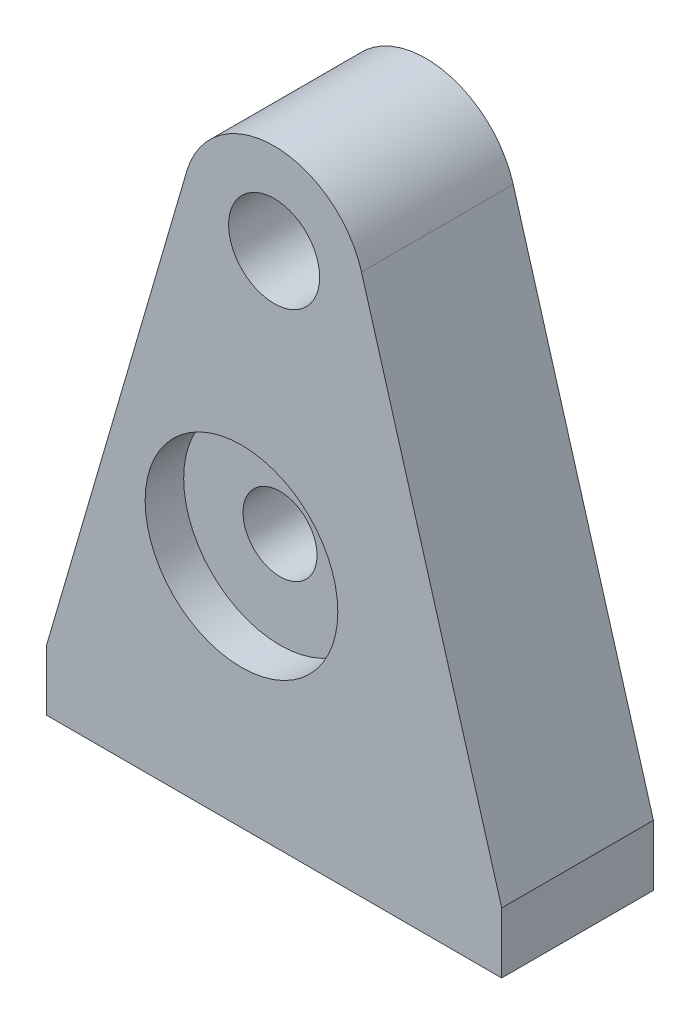
ISO-10303-21;
HEADER;
FILE_DESCRIPTION(('STEP AP214'),'2;1');
FILE_NAME('part.step','',(''),(''),'','','');
FILE_SCHEMA(('AUTOMOTIVE_DESIGN { 1 0 10303 214 1 1 1 1 }'));
ENDSEC;
DATA;
#1=APPLICATION_CONTEXT('core data for automotive mechanical design processes');
#2=APPLICATION_PROTOCOL_DEFINITION('international standard','automotive_design',2000,#1);
#3=PRODUCT_CONTEXT('',#1,'mechanical');
#4=PRODUCT('Part','Part','',(#3));
#5=PRODUCT_RELATED_PRODUCT_CATEGORY('part','',(#4));
#6=PRODUCT_DEFINITION_FORMATION('','',#4);
#7=PRODUCT_DEFINITION_CONTEXT('part definition',#1,'design');
#8=PRODUCT_DEFINITION('design','',#6,#7);
#9=PRODUCT_DEFINITION_SHAPE('','',#8);
#10=(LENGTH_UNIT() NAMED_UNIT(*) SI_UNIT(.MILLI.,.METRE.));
#11=(NAMED_UNIT(*) PLANE_ANGLE_UNIT() SI_UNIT($,.RADIAN.));
#12=(NAMED_UNIT(*) SI_UNIT($,.STERADIAN.) SOLID_ANGLE_UNIT());
#13=UNCERTAINTY_MEASURE_WITH_UNIT(LENGTH_MEASURE(1.E-05),#10,'distance_accuracy_value','');
#14=(GEOMETRIC_REPRESENTATION_CONTEXT(3) GLOBAL_UNCERTAINTY_ASSIGNED_CONTEXT((#13)) GLOBAL_UNIT_ASSIGNED_CONTEXT((#10,
#11,#12)) REPRESENTATION_CONTEXT('',''));
#15=CARTESIAN_POINT('',(0.,0.,0.));
#16=DIRECTION('',(0.,0.,1.));
#17=DIRECTION('',(1.,0.,0.));
#18=AXIS2_PLACEMENT_3D('',#15,#16,#17);
#19=CARTESIAN_POINT('',(7.5,15.,5.));
#20=DIRECTION('',(0.,0.,1.));
#21=DIRECTION('',(1.,0.,0.));
#22=AXIS2_PLACEMENT_3D('',#19,#20,#21);
#23=PLANE('',#22);
#24=CARTESIAN_POINT('',(6.42340323711557,5.75018881602358,5.));
#25=DIRECTION('',(0.,0.,1.));
#26=DIRECTION('',(1.,0.,0.));
#27=AXIS2_PLACEMENT_3D('',#24,#25,#26);
#28=CIRCLE('',#27,3.175);
#29=CARTESIAN_POINT('',(9.59840323711557,5.75018881602358,5.));
#30=VERTEX_POINT('',#29);
#31=EDGE_CURVE('E193',#30,#30,#28,.T.);
#32=ORIENTED_EDGE('',*,*,#31,.F.);
#33=EDGE_LOOP('',(#32));
#34=FACE_BOUND('',#33,.T.);
#35=DIRECTION('',(0.,-1.,0.));
#36=VECTOR('',#35,1.);
#37=CARTESIAN_POINT('',(0.,0.,5.));
#38=LINE('',#37,#36);
#39=CARTESIAN_POINT('',(0.,0.,5.));
#40=VERTEX_POINT('',#39);
#41=CARTESIAN_POINT('',(0.,-2.,5.));
#42=VERTEX_POINT('',#41);
#43=EDGE_CURVE('E141',#40,#42,#38,.T.);
#44=ORIENTED_EDGE('',*,*,#43,.T.);
#45=DIRECTION('',(1.,0.,0.));
#46=VECTOR('',#45,1.);
#47=CARTESIAN_POINT('',(0.,-2.,5.));
#48=LINE('',#47,#46);
#49=CARTESIAN_POINT('',(15.,-2.,5.));
#50=VERTEX_POINT('',#49);
#51=EDGE_CURVE('E99',#42,#50,#48,.T.);
#52=ORIENTED_EDGE('',*,*,#51,.T.);
#53=DIRECTION('',(0.,1.,0.));
#54=VECTOR('',#53,1.);
#55=CARTESIAN_POINT('',(15.,0.,5.));
#56=LINE('',#55,#54);
#57=CARTESIAN_POINT('',(15.,0.,5.));
#58=VERTEX_POINT('',#57);
#59=EDGE_CURVE('E112',#50,#58,#56,.T.);
#60=ORIENTED_EDGE('',*,*,#59,.T.);
#61=DIRECTION('',(-0.28,0.96,0.));
#62=VECTOR('',#61,1.);
#63=CARTESIAN_POINT('',(15.,0.,5.));
#64=LINE('',#63,#62);
#65=CARTESIAN_POINT('',(10.38,15.84,5.));
#66=VERTEX_POINT('',#65);
#67=EDGE_CURVE('E106',#58,#66,#64,.T.);
#68=ORIENTED_EDGE('',*,*,#67,.T.);
#69=CARTESIAN_POINT('',(7.5,15.,5.));
#70=DIRECTION('',(0.,0.,1.));
#71=DIRECTION('',(1.,0.,0.));
#72=AXIS2_PLACEMENT_3D('',#69,#70,#71);
#73=CIRCLE('',#72,3.);
#74=CARTESIAN_POINT('',(4.62,15.84,5.));
#75=VERTEX_POINT('',#74);
#76=EDGE_CURVE('E110',#66,#75,#73,.T.);
#77=ORIENTED_EDGE('',*,*,#76,.T.);
#78=DIRECTION('',(-0.28,-0.96,0.));
#79=VECTOR('',#78,1.);
#80=CARTESIAN_POINT('',(0.,0.,5.));
#81=LINE('',#80,#79);
#82=EDGE_CURVE('E62',#75,#40,#81,.T.);
#83=ORIENTED_EDGE('',*,*,#82,.T.);
#84=EDGE_LOOP('',(#44,#52,#60,#68,#77,#83));
#85=FACE_BOUND('',#84,.T.);
#86=CARTESIAN_POINT('',(7.5,15.,5.));
#87=DIRECTION('',(0.,0.,1.));
#88=DIRECTION('',(1.,0.,0.));
#89=AXIS2_PLACEMENT_3D('',#86,#87,#88);
#90=CIRCLE('',#89,1.5);
#91=CARTESIAN_POINT('',(9.,15.,5.));
#92=VERTEX_POINT('',#91);
#93=EDGE_CURVE('E134',#92,#92,#90,.T.);
#94=ORIENTED_EDGE('',*,*,#93,.F.);
#95=EDGE_LOOP('',(#94));
#96=FACE_BOUND('',#95,.T.);
#97=ADVANCED_FACE('F45',(#34,#85,#96),#23,.T.);
#98=CARTESIAN_POINT('',(7.5,15.,0.));
#99=DIRECTION('',(0.,0.,1.));
#100=DIRECTION('',(1.,0.,0.));
#101=AXIS2_PLACEMENT_3D('',#98,#99,#100);
#102=PLANE('',#101);
#103=CARTESIAN_POINT('',(6.42340323711557,5.75018881602358,0.));
#104=DIRECTION('',(0.,0.,1.));
#105=DIRECTION('',(1.,0.,0.));
#106=AXIS2_PLACEMENT_3D('',#103,#104,#105);
#107=CIRCLE('',#106,1.2192);
#108=CARTESIAN_POINT('',(7.64260323711557,5.75018881602358,0.));
#109=VERTEX_POINT('',#108);
#110=EDGE_CURVE('E200',#109,#109,#107,.T.);
#111=ORIENTED_EDGE('',*,*,#110,.T.);
#112=EDGE_LOOP('',(#111));
#113=FACE_BOUND('',#112,.T.);
#114=DIRECTION('',(0.,-1.,0.));
#115=VECTOR('',#114,1.);
#116=CARTESIAN_POINT('',(0.,0.,0.));
#117=LINE('',#116,#115);
#118=CARTESIAN_POINT('',(0.,0.,0.));
#119=VERTEX_POINT('',#118);
#120=CARTESIAN_POINT('',(0.,-2.,0.));
#121=VERTEX_POINT('',#120);
#122=EDGE_CURVE('E130',#119,#121,#117,.T.);
#123=ORIENTED_EDGE('',*,*,#122,.F.);
#124=DIRECTION('',(-0.28,-0.96,0.));
#125=VECTOR('',#124,1.);
#126=CARTESIAN_POINT('',(0.,0.,0.));
#127=LINE('',#126,#125);
#128=CARTESIAN_POINT('',(4.62,15.84,0.));
#129=VERTEX_POINT('',#128);
#130=EDGE_CURVE('E91',#129,#119,#127,.T.);
#131=ORIENTED_EDGE('',*,*,#130,.F.);
#132=CARTESIAN_POINT('',(7.5,15.,0.));
#133=DIRECTION('',(0.,0.,1.));
#134=DIRECTION('',(1.,0.,0.));
#135=AXIS2_PLACEMENT_3D('',#132,#133,#134);
#136=CIRCLE('',#135,3.);
#137=CARTESIAN_POINT('',(10.38,15.84,0.));
#138=VERTEX_POINT('',#137);
#139=EDGE_CURVE('E85',#138,#129,#136,.T.);
#140=ORIENTED_EDGE('',*,*,#139,.F.);
#141=DIRECTION('',(-0.28,0.96,0.));
#142=VECTOR('',#141,1.);
#143=CARTESIAN_POINT('',(15.,0.,0.));
#144=LINE('',#143,#142);
#145=CARTESIAN_POINT('',(15.,0.,0.));
#146=VERTEX_POINT('',#145);
#147=EDGE_CURVE('E120',#146,#138,#144,.T.);
#148=ORIENTED_EDGE('',*,*,#147,.F.);
#149=DIRECTION('',(0.,1.,0.));
#150=VECTOR('',#149,1.);
#151=CARTESIAN_POINT('',(15.,0.,0.));
#152=LINE('',#151,#150);
#153=CARTESIAN_POINT('',(15.,-2.,0.));
#154=VERTEX_POINT('',#153);
#155=EDGE_CURVE('E136',#154,#146,#152,.T.);
#156=ORIENTED_EDGE('',*,*,#155,.F.);
#157=DIRECTION('',(1.,0.,0.));
#158=VECTOR('',#157,1.);
#159=CARTESIAN_POINT('',(0.,-2.,0.));
#160=LINE('',#159,#158);
#161=EDGE_CURVE('E133',#121,#154,#160,.T.);
#162=ORIENTED_EDGE('',*,*,#161,.F.);
#163=EDGE_LOOP('',(#123,#131,#140,#148,#156,#162));
#164=FACE_BOUND('',#163,.T.);
#165=CARTESIAN_POINT('',(7.5,15.,0.));
#166=DIRECTION('',(0.,0.,1.));
#167=DIRECTION('',(1.,0.,0.));
#168=AXIS2_PLACEMENT_3D('',#165,#166,#167);
#169=CIRCLE('',#168,1.5);
#170=CARTESIAN_POINT('',(9.,15.,0.));
#171=VERTEX_POINT('',#170);
#172=EDGE_CURVE('E203',#171,#171,#169,.T.);
#173=ORIENTED_EDGE('',*,*,#172,.T.);
#174=EDGE_LOOP('',(#173));
#175=FACE_BOUND('',#174,.T.);
#176=ADVANCED_FACE('F150',(#113,#164,#175),#102,.F.);
#177=CARTESIAN_POINT('',(0.,0.,5.));
#178=DIRECTION('',(1.,0.,0.));
#179=DIRECTION('',(0.,1.,0.));
#180=AXIS2_PLACEMENT_3D('',#177,#178,#179);
#181=PLANE('',#180);
#182=ORIENTED_EDGE('',*,*,#122,.T.);
#183=DIRECTION('',(0.,0.,-1.));
#184=VECTOR('',#183,1.);
#185=CARTESIAN_POINT('',(0.,-2.,5.));
#186=LINE('',#185,#184);
#187=EDGE_CURVE('E11',#42,#121,#186,.T.);
#188=ORIENTED_EDGE('',*,*,#187,.F.);
#189=ORIENTED_EDGE('',*,*,#43,.F.);
#190=DIRECTION('',(0.,0.,-1.));
#191=VECTOR('',#190,1.);
#192=CARTESIAN_POINT('',(0.,0.,5.));
#193=LINE('',#192,#191);
#194=EDGE_CURVE('E126',#40,#119,#193,.T.);
#195=ORIENTED_EDGE('',*,*,#194,.T.);
#196=EDGE_LOOP('',(#182,#188,#189,#195));
#197=FACE_BOUND('',#196,.T.);
#198=ADVANCED_FACE('F47',(#197),#181,.F.);
#199=CARTESIAN_POINT('',(0.,-2.,5.));
#200=DIRECTION('',(0.,1.,0.));
#201=DIRECTION('',(0.,0.,1.));
#202=AXIS2_PLACEMENT_3D('',#199,#200,#201);
#203=PLANE('',#202);
#204=ORIENTED_EDGE('',*,*,#161,.T.);
#205=DIRECTION('',(0.,0.,-1.));
#206=VECTOR('',#205,1.);
#207=CARTESIAN_POINT('',(15.,-2.,5.));
#208=LINE('',#207,#206);
#209=EDGE_CURVE('E54',#50,#154,#208,.T.);
#210=ORIENTED_EDGE('',*,*,#209,.F.);
#211=ORIENTED_EDGE('',*,*,#51,.F.);
#212=ORIENTED_EDGE('',*,*,#187,.T.);
#213=EDGE_LOOP('',(#204,#210,#211,#212));
#214=FACE_BOUND('',#213,.T.);
#215=ADVANCED_FACE('F259',(#214),#203,.F.);
#216=CARTESIAN_POINT('',(15.,0.,5.));
#217=DIRECTION('',(-1.,0.,0.));
#218=DIRECTION('',(0.,0.,1.));
#219=AXIS2_PLACEMENT_3D('',#216,#217,#218);
#220=PLANE('',#219);
#221=ORIENTED_EDGE('',*,*,#155,.T.);
#222=DIRECTION('',(0.,0.,-1.));
#223=VECTOR('',#222,1.);
#224=CARTESIAN_POINT('',(15.,0.,5.));
#225=LINE('',#224,#223);
#226=EDGE_CURVE('E121',#58,#146,#225,.T.);
#227=ORIENTED_EDGE('',*,*,#226,.F.);
#228=ORIENTED_EDGE('',*,*,#59,.F.);
#229=ORIENTED_EDGE('',*,*,#209,.T.);
#230=EDGE_LOOP('',(#221,#227,#228,#229));
#231=FACE_BOUND('',#230,.T.);
#232=ADVANCED_FACE('F147',(#231),#220,.F.);
#233=CARTESIAN_POINT('',(15.,0.,5.));
#234=DIRECTION('',(-0.96,-0.28,0.));
#235=DIRECTION('',(0.28,-0.96,0.));
#236=AXIS2_PLACEMENT_3D('',#233,#234,#235);
#237=PLANE('',#236);
#238=ORIENTED_EDGE('',*,*,#147,.T.);
#239=DIRECTION('',(0.,0.,-1.));
#240=VECTOR('',#239,1.);
#241=CARTESIAN_POINT('',(10.38,15.84,5.));
#242=LINE('',#241,#240);
#243=EDGE_CURVE('E117',#66,#138,#242,.T.);
#244=ORIENTED_EDGE('',*,*,#243,.F.);
#245=ORIENTED_EDGE('',*,*,#67,.F.);
#246=ORIENTED_EDGE('',*,*,#226,.T.);
#247=EDGE_LOOP('',(#238,#244,#245,#246));
#248=FACE_BOUND('',#247,.T.);
#249=ADVANCED_FACE('F118',(#248),#237,.F.);
#250=CARTESIAN_POINT('',(7.5,15.,5.));
#251=DIRECTION('',(0.,0.,-1.));
#252=DIRECTION('',(-1.,0.,0.));
#253=AXIS2_PLACEMENT_3D('',#250,#251,#252);
#254=CYLINDRICAL_SURFACE('',#253,3.);
#255=ORIENTED_EDGE('',*,*,#139,.T.);
#256=DIRECTION('',(0.,0.,-1.));
#257=VECTOR('',#256,1.);
#258=CARTESIAN_POINT('',(4.62,15.84,5.));
#259=LINE('',#258,#257);
#260=EDGE_CURVE('E122',#75,#129,#259,.T.);
#261=ORIENTED_EDGE('',*,*,#260,.F.);
#262=ORIENTED_EDGE('',*,*,#76,.F.);
#263=ORIENTED_EDGE('',*,*,#243,.T.);
#264=EDGE_LOOP('',(#255,#261,#262,#263));
#265=FACE_BOUND('',#264,.T.);
#266=ADVANCED_FACE('F124',(#265),#254,.T.);
#267=CARTESIAN_POINT('',(0.,0.,5.));
#268=DIRECTION('',(0.96,-0.28,0.));
#269=DIRECTION('',(0.28,0.96,0.));
#270=AXIS2_PLACEMENT_3D('',#267,#268,#269);
#271=PLANE('',#270);
#272=ORIENTED_EDGE('',*,*,#130,.T.);
#273=ORIENTED_EDGE('',*,*,#194,.F.);
#274=ORIENTED_EDGE('',*,*,#82,.F.);
#275=ORIENTED_EDGE('',*,*,#260,.T.);
#276=EDGE_LOOP('',(#272,#273,#274,#275));
#277=FACE_BOUND('',#276,.T.);
#278=ADVANCED_FACE('F155',(#277),#271,.F.);
#279=CARTESIAN_POINT('',(7.5,15.,5.));
#280=DIRECTION('',(0.,0.,-1.));
#281=DIRECTION('',(-1.,0.,0.));
#282=AXIS2_PLACEMENT_3D('',#279,#280,#281);
#283=CYLINDRICAL_SURFACE('',#282,1.5);
#284=ORIENTED_EDGE('',*,*,#93,.T.);
#285=EDGE_LOOP('',(#284));
#286=FACE_BOUND('',#285,.T.);
#287=ORIENTED_EDGE('',*,*,#172,.F.);
#288=EDGE_LOOP('',(#287));
#289=FACE_BOUND('',#288,.T.);
#290=ADVANCED_FACE('F157',(#286,#289),#283,.F.);
#291=CARTESIAN_POINT('',(6.42340323711557,5.75018881602358,5.));
#292=DIRECTION('',(0.,0.,1.));
#293=DIRECTION('',(1.,0.,0.));
#294=AXIS2_PLACEMENT_3D('',#291,#292,#293);
#295=CYLINDRICAL_SURFACE('',#294,1.2192);
#296=ORIENTED_EDGE('',*,*,#110,.F.);
#297=EDGE_LOOP('',(#296));
#298=FACE_BOUND('',#297,.T.);
#299=CARTESIAN_POINT('',(6.42340323711557,5.75018881602358,3.73));
#300=DIRECTION('',(0.,0.,1.));
#301=DIRECTION('',(1.,0.,0.));
#302=AXIS2_PLACEMENT_3D('',#299,#300,#301);
#303=CIRCLE('',#302,1.2192);
#304=CARTESIAN_POINT('',(7.64260323711557,5.75018881602358,3.73));
#305=VERTEX_POINT('',#304);
#306=EDGE_CURVE('E195',#305,#305,#303,.T.);
#307=ORIENTED_EDGE('',*,*,#306,.T.);
#308=EDGE_LOOP('',(#307));
#309=FACE_BOUND('',#308,.T.);
#310=ADVANCED_FACE('F164',(#298,#309),#295,.F.);
#311=CARTESIAN_POINT('',(7.64260323711557,5.75018881602358,3.73));
#312=DIRECTION('',(0.,0.,-1.));
#313=DIRECTION('',(-1.,0.,0.));
#314=AXIS2_PLACEMENT_3D('',#311,#312,#313);
#315=PLANE('',#314);
#316=ORIENTED_EDGE('',*,*,#306,.F.);
#317=EDGE_LOOP('',(#316));
#318=FACE_BOUND('',#317,.T.);
#319=CARTESIAN_POINT('',(6.42340323711557,5.75018881602358,3.73));
#320=DIRECTION('',(0.,0.,1.));
#321=DIRECTION('',(1.,0.,0.));
#322=AXIS2_PLACEMENT_3D('',#319,#320,#321);
#323=CIRCLE('',#322,3.175);
#324=CARTESIAN_POINT('',(9.59840323711557,5.75018881602358,3.73));
#325=VERTEX_POINT('',#324);
#326=EDGE_CURVE('E191',#325,#325,#323,.T.);
#327=ORIENTED_EDGE('',*,*,#326,.T.);
#328=EDGE_LOOP('',(#327));
#329=FACE_BOUND('',#328,.T.);
#330=ADVANCED_FACE('F179',(#318,#329),#315,.F.);
#331=CARTESIAN_POINT('',(6.42340323711557,5.75018881602358,5.));
#332=DIRECTION('',(0.,0.,1.));
#333=DIRECTION('',(1.,0.,0.));
#334=AXIS2_PLACEMENT_3D('',#331,#332,#333);
#335=CYLINDRICAL_SURFACE('',#334,3.175);
#336=ORIENTED_EDGE('',*,*,#326,.F.);
#337=EDGE_LOOP('',(#336));
#338=FACE_BOUND('',#337,.T.);
#339=ORIENTED_EDGE('',*,*,#31,.T.);
#340=EDGE_LOOP('',(#339));
#341=FACE_BOUND('',#340,.T.);
#342=ADVANCED_FACE('F183',(#338,#341),#335,.F.);
#343=CLOSED_SHELL('',(#97,#176,#198,#215,#232,#249,#266,#278,#290,#310,#330,#342));
#344=MANIFOLD_SOLID_BREP('B2',#343);
#345=ADVANCED_BREP_SHAPE_REPRESENTATION('',(#18,#344),#14);
#346=SHAPE_DEFINITION_REPRESENTATION(#9,#345);
ENDSEC;
END-ISO-10303-21;
